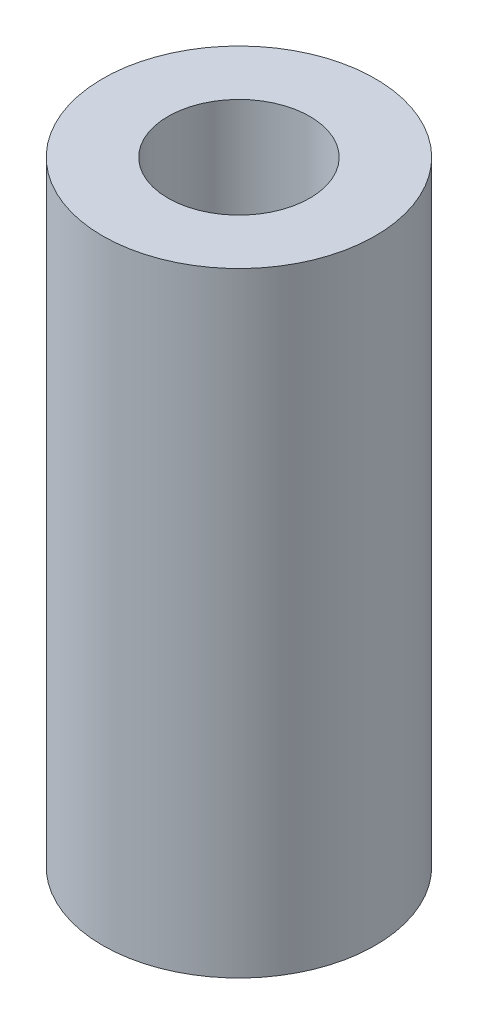
ISO-10303-21;
HEADER;
FILE_DESCRIPTION(('STEP AP214'),'2;1');
FILE_NAME('part.step','',(''),(''),'','','');
FILE_SCHEMA(('AUTOMOTIVE_DESIGN { 1 0 10303 214 1 1 1 1 }'));
ENDSEC;
DATA;
#1=APPLICATION_CONTEXT('core data for automotive mechanical design processes');
#2=APPLICATION_PROTOCOL_DEFINITION('international standard','automotive_design',2000,#1);
#3=PRODUCT_CONTEXT('',#1,'mechanical');
#4=PRODUCT('Part','Part','',(#3));
#5=PRODUCT_RELATED_PRODUCT_CATEGORY('part','',(#4));
#6=PRODUCT_DEFINITION_FORMATION('','',#4);
#7=PRODUCT_DEFINITION_CONTEXT('part definition',#1,'design');
#8=PRODUCT_DEFINITION('design','',#6,#7);
#9=PRODUCT_DEFINITION_SHAPE('','',#8);
#10=(LENGTH_UNIT() NAMED_UNIT(*) SI_UNIT(.MILLI.,.METRE.));
#11=(NAMED_UNIT(*) PLANE_ANGLE_UNIT() SI_UNIT($,.RADIAN.));
#12=(NAMED_UNIT(*) SI_UNIT($,.STERADIAN.) SOLID_ANGLE_UNIT());
#13=UNCERTAINTY_MEASURE_WITH_UNIT(LENGTH_MEASURE(1.E-05),#10,'distance_accuracy_value','');
#14=(GEOMETRIC_REPRESENTATION_CONTEXT(3) GLOBAL_UNCERTAINTY_ASSIGNED_CONTEXT((#13)) GLOBAL_UNIT_ASSIGNED_CONTEXT((#10,
#11,#12)) REPRESENTATION_CONTEXT('',''));
#15=CARTESIAN_POINT('',(0.,0.,0.));
#16=DIRECTION('',(0.,0.,1.));
#17=DIRECTION('',(1.,0.,0.));
#18=AXIS2_PLACEMENT_3D('',#15,#16,#17);
#19=CARTESIAN_POINT('',(0.,16.51,0.));
#20=DIRECTION('',(0.,1.,0.));
#21=DIRECTION('',(0.,0.,1.));
#22=AXIS2_PLACEMENT_3D('',#19,#20,#21);
#23=PLANE('',#22);
#24=CARTESIAN_POINT('',(0.,16.51,0.));
#25=DIRECTION('',(0.,1.,0.));
#26=DIRECTION('',(0.,0.,1.));
#27=AXIS2_PLACEMENT_3D('',#24,#25,#26);
#28=CIRCLE('',#27,3.66217534174825);
#29=CARTESIAN_POINT('',(0.,16.51,3.66217534174825));
#30=VERTEX_POINT('',#29);
#31=EDGE_CURVE('E10',#30,#30,#28,.T.);
#32=ORIENTED_EDGE('',*,*,#31,.T.);
#33=EDGE_LOOP('',(#32));
#34=FACE_BOUND('',#33,.T.);
#35=CARTESIAN_POINT('',(0.,16.51,0.));
#36=DIRECTION('',(0.,1.,0.));
#37=DIRECTION('',(0.,0.,1.));
#38=AXIS2_PLACEMENT_3D('',#35,#36,#37);
#39=CIRCLE('',#38,1.905);
#40=CARTESIAN_POINT('',(0.,16.51,1.905));
#41=VERTEX_POINT('',#40);
#42=EDGE_CURVE('E56',#41,#41,#39,.T.);
#43=ORIENTED_EDGE('',*,*,#42,.F.);
#44=EDGE_LOOP('',(#43));
#45=FACE_BOUND('',#44,.T.);
#46=ADVANCED_FACE('F43',(#34,#45),#23,.T.);
#47=CARTESIAN_POINT('',(0.,0.,0.));
#48=DIRECTION('',(0.,1.,0.));
#49=DIRECTION('',(0.,0.,1.));
#50=AXIS2_PLACEMENT_3D('',#47,#48,#49);
#51=PLANE('',#50);
#52=CARTESIAN_POINT('',(0.,0.,0.));
#53=DIRECTION('',(0.,1.,0.));
#54=DIRECTION('',(0.,0.,1.));
#55=AXIS2_PLACEMENT_3D('',#52,#53,#54);
#56=CIRCLE('',#55,3.66217534174825);
#57=CARTESIAN_POINT('',(0.,0.,3.66217534174825));
#58=VERTEX_POINT('',#57);
#59=EDGE_CURVE('E47',#58,#58,#56,.T.);
#60=ORIENTED_EDGE('',*,*,#59,.F.);
#61=EDGE_LOOP('',(#60));
#62=FACE_BOUND('',#61,.T.);
#63=CARTESIAN_POINT('',(0.,0.,0.));
#64=DIRECTION('',(0.,1.,0.));
#65=DIRECTION('',(0.,0.,1.));
#66=AXIS2_PLACEMENT_3D('',#63,#64,#65);
#67=CIRCLE('',#66,1.905);
#68=CARTESIAN_POINT('',(0.,0.,1.905));
#69=VERTEX_POINT('',#68);
#70=EDGE_CURVE('E58',#69,#69,#67,.T.);
#71=ORIENTED_EDGE('',*,*,#70,.T.);
#72=EDGE_LOOP('',(#71));
#73=FACE_BOUND('',#72,.T.);
#74=ADVANCED_FACE('F70',(#62,#73),#51,.F.);
#75=CARTESIAN_POINT('',(0.,16.51,0.));
#76=DIRECTION('',(0.,-1.,0.));
#77=DIRECTION('',(0.,0.,-1.));
#78=AXIS2_PLACEMENT_3D('',#75,#76,#77);
#79=CYLINDRICAL_SURFACE('',#78,3.66217534174825);
#80=ORIENTED_EDGE('',*,*,#31,.F.);
#81=EDGE_LOOP('',(#80));
#82=FACE_BOUND('',#81,.T.);
#83=ORIENTED_EDGE('',*,*,#59,.T.);
#84=EDGE_LOOP('',(#83));
#85=FACE_BOUND('',#84,.T.);
#86=ADVANCED_FACE('F45',(#82,#85),#79,.T.);
#87=CARTESIAN_POINT('',(0.,16.51,0.));
#88=DIRECTION('',(0.,-1.,0.));
#89=DIRECTION('',(0.,0.,-1.));
#90=AXIS2_PLACEMENT_3D('',#87,#88,#89);
#91=CYLINDRICAL_SURFACE('',#90,1.905);
#92=ORIENTED_EDGE('',*,*,#42,.T.);
#93=EDGE_LOOP('',(#92));
#94=FACE_BOUND('',#93,.T.);
#95=ORIENTED_EDGE('',*,*,#70,.F.);
#96=EDGE_LOOP('',(#95));
#97=FACE_BOUND('',#96,.T.);
#98=ADVANCED_FACE('F66',(#94,#97),#91,.F.);
#99=CLOSED_SHELL('',(#46,#74,#86,#98));
#100=MANIFOLD_SOLID_BREP('B2',#99);
#101=ADVANCED_BREP_SHAPE_REPRESENTATION('',(#18,#100),#14);
#102=SHAPE_DEFINITION_REPRESENTATION(#9,#101);
ENDSEC;
END-ISO-10303-21;
